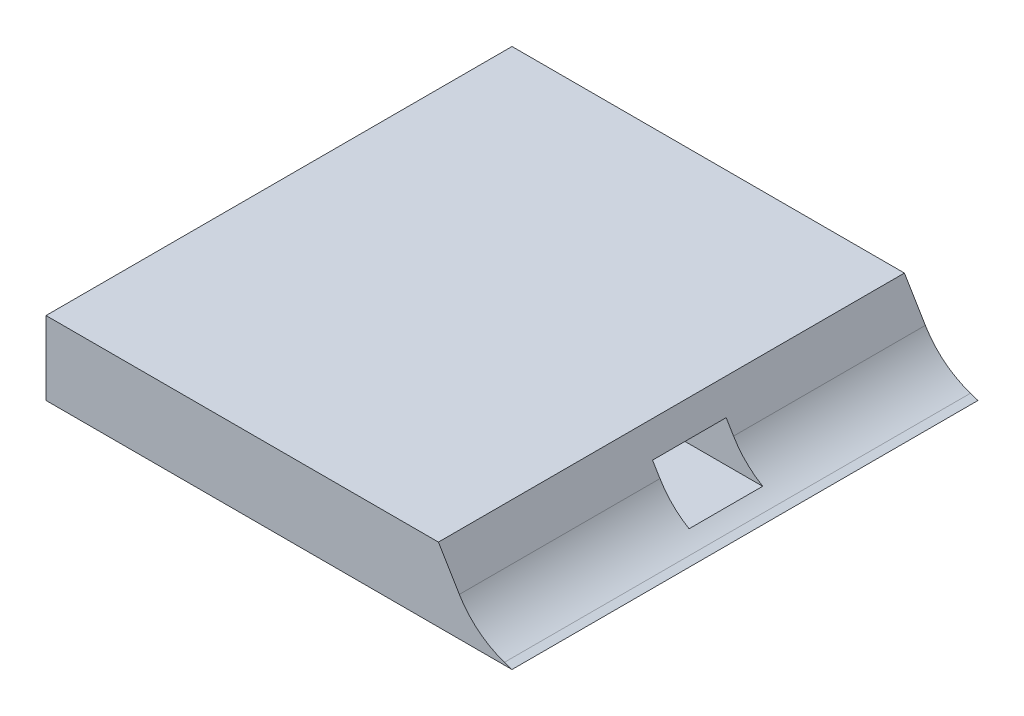
ISO-10303-21;
HEADER;
FILE_DESCRIPTION(('STEP AP214'),'2;1');
FILE_NAME('part.step','',(''),(''),'','','');
FILE_SCHEMA(('AUTOMOTIVE_DESIGN { 1 0 10303 214 1 1 1 1 }'));
ENDSEC;
DATA;
#1=APPLICATION_CONTEXT('core data for automotive mechanical design processes');
#2=APPLICATION_PROTOCOL_DEFINITION('international standard','automotive_design',2000,#1);
#3=PRODUCT_CONTEXT('',#1,'mechanical');
#4=PRODUCT('Part','Part','',(#3));
#5=PRODUCT_RELATED_PRODUCT_CATEGORY('part','',(#4));
#6=PRODUCT_DEFINITION_FORMATION('','',#4);
#7=PRODUCT_DEFINITION_CONTEXT('part definition',#1,'design');
#8=PRODUCT_DEFINITION('design','',#6,#7);
#9=PRODUCT_DEFINITION_SHAPE('','',#8);
#10=(LENGTH_UNIT() NAMED_UNIT(*) SI_UNIT(.MILLI.,.METRE.));
#11=(NAMED_UNIT(*) PLANE_ANGLE_UNIT() SI_UNIT($,.RADIAN.));
#12=(NAMED_UNIT(*) SI_UNIT($,.STERADIAN.) SOLID_ANGLE_UNIT());
#13=UNCERTAINTY_MEASURE_WITH_UNIT(LENGTH_MEASURE(1.E-05),#10,'distance_accuracy_value','');
#14=(GEOMETRIC_REPRESENTATION_CONTEXT(3) GLOBAL_UNCERTAINTY_ASSIGNED_CONTEXT((#13)) GLOBAL_UNIT_ASSIGNED_CONTEXT((#10,
#11,#12)) REPRESENTATION_CONTEXT('',''));
#15=CARTESIAN_POINT('',(0.,0.,0.));
#16=DIRECTION('',(0.,0.,1.));
#17=DIRECTION('',(1.,0.,0.));
#18=AXIS2_PLACEMENT_3D('',#15,#16,#17);
#19=CARTESIAN_POINT('',(-45.,15.,-47.5));
#20=DIRECTION('',(0.,0.,1.));
#21=DIRECTION('',(1.,0.,0.));
#22=AXIS2_PLACEMENT_3D('',#19,#20,#21);
#23=PLANE('',#22);
#24=DIRECTION('',(0.514495755427526,-0.857492925712544,0.));
#25=VECTOR('',#24,1.);
#26=CARTESIAN_POINT('',(13.8235294117647,50.2941176470588,-47.5));
#27=LINE('',#26,#25);
#28=CARTESIAN_POINT('',(35.,15.,-47.5));
#29=VERTEX_POINT('',#28);
#30=CARTESIAN_POINT('',(39.2644857602636,7.89252373289388,-47.5));
#31=VERTEX_POINT('',#30);
#32=EDGE_CURVE('E121',#29,#31,#27,.T.);
#33=ORIENTED_EDGE('',*,*,#32,.T.);
#34=CARTESIAN_POINT('',(53.8418654973769,16.6389515751618,-47.5));
#35=DIRECTION('',(0.,0.,1.));
#36=DIRECTION('',(1.,0.,0.));
#37=AXIS2_PLACEMENT_3D('',#34,#35,#36);
#38=CIRCLE('',#37,17.);
#39=CARTESIAN_POINT('',(48.4659934750907,0.511335508303099,-47.5));
#40=VERTEX_POINT('',#39);
#41=EDGE_CURVE('E11',#31,#40,#38,.T.);
#42=ORIENTED_EDGE('',*,*,#41,.T.);
#43=DIRECTION('',(0.948683298050514,-0.316227766016838,0.));
#44=VECTOR('',#43,1.);
#45=CARTESIAN_POINT('',(-40.,30.,-47.5));
#46=LINE('',#45,#44);
#47=CARTESIAN_POINT('',(50.,0.,-47.5));
#48=VERTEX_POINT('',#47);
#49=EDGE_CURVE('E188',#40,#48,#46,.T.);
#50=ORIENTED_EDGE('',*,*,#49,.T.);
#51=DIRECTION('',(-1.,0.,0.));
#52=VECTOR('',#51,1.);
#53=CARTESIAN_POINT('',(-45.,0.,-47.5));
#54=LINE('',#53,#52);
#55=CARTESIAN_POINT('',(-45.,0.,-47.5));
#56=VERTEX_POINT('',#55);
#57=EDGE_CURVE('E149',#48,#56,#54,.T.);
#58=ORIENTED_EDGE('',*,*,#57,.T.);
#59=DIRECTION('',(0.,-1.,0.));
#60=VECTOR('',#59,1.);
#61=CARTESIAN_POINT('',(-45.,15.,-47.5));
#62=LINE('',#61,#60);
#63=CARTESIAN_POINT('',(-45.,15.,-47.5));
#64=VERTEX_POINT('',#63);
#65=EDGE_CURVE('E143',#64,#56,#62,.T.);
#66=ORIENTED_EDGE('',*,*,#65,.F.);
#67=DIRECTION('',(-1.,0.,0.));
#68=VECTOR('',#67,1.);
#69=CARTESIAN_POINT('',(-45.,15.,-47.5));
#70=LINE('',#69,#68);
#71=EDGE_CURVE('E145',#29,#64,#70,.T.);
#72=ORIENTED_EDGE('',*,*,#71,.F.);
#73=EDGE_LOOP('',(#33,#42,#50,#58,#66,#72));
#74=FACE_BOUND('',#73,.T.);
#75=ADVANCED_FACE('F33',(#74),#23,.F.);
#76=CARTESIAN_POINT('',(-45.,15.,47.5));
#77=DIRECTION('',(1.,0.,0.));
#78=DIRECTION('',(0.,0.,-1.));
#79=AXIS2_PLACEMENT_3D('',#76,#77,#78);
#80=PLANE('',#79);
#81=DIRECTION('',(0.,0.,1.));
#82=VECTOR('',#81,1.);
#83=CARTESIAN_POINT('',(-45.,0.,47.5));
#84=LINE('',#83,#82);
#85=CARTESIAN_POINT('',(-45.,0.,47.5));
#86=VERTEX_POINT('',#85);
#87=EDGE_CURVE('E151',#56,#86,#84,.T.);
#88=ORIENTED_EDGE('',*,*,#87,.T.);
#89=DIRECTION('',(0.,-1.,0.));
#90=VECTOR('',#89,1.);
#91=CARTESIAN_POINT('',(-45.,15.,47.5));
#92=LINE('',#91,#90);
#93=CARTESIAN_POINT('',(-45.,15.,47.5));
#94=VERTEX_POINT('',#93);
#95=EDGE_CURVE('E141',#94,#86,#92,.T.);
#96=ORIENTED_EDGE('',*,*,#95,.F.);
#97=DIRECTION('',(0.,0.,1.));
#98=VECTOR('',#97,1.);
#99=CARTESIAN_POINT('',(-45.,15.,47.5));
#100=LINE('',#99,#98);
#101=EDGE_CURVE('E139',#64,#94,#100,.T.);
#102=ORIENTED_EDGE('',*,*,#101,.F.);
#103=ORIENTED_EDGE('',*,*,#65,.T.);
#104=EDGE_LOOP('',(#88,#96,#102,#103));
#105=FACE_BOUND('',#104,.T.);
#106=ADVANCED_FACE('F219',(#105),#80,.F.);
#107=CARTESIAN_POINT('',(-45.,15.,47.5));
#108=DIRECTION('',(0.,0.,-1.));
#109=DIRECTION('',(-1.,0.,0.));
#110=AXIS2_PLACEMENT_3D('',#107,#108,#109);
#111=PLANE('',#110);
#112=DIRECTION('',(1.,0.,0.));
#113=VECTOR('',#112,1.);
#114=CARTESIAN_POINT('',(-45.,0.,47.5));
#115=LINE('',#114,#113);
#116=CARTESIAN_POINT('',(50.,0.,47.5));
#117=VERTEX_POINT('',#116);
#118=EDGE_CURVE('E154',#86,#117,#115,.T.);
#119=ORIENTED_EDGE('',*,*,#118,.T.);
#120=DIRECTION('',(0.948683298050514,-0.316227766016838,0.));
#121=VECTOR('',#120,1.);
#122=CARTESIAN_POINT('',(42.5,2.5,47.5));
#123=LINE('',#122,#121);
#124=CARTESIAN_POINT('',(48.4659934750907,0.511335508303109,47.5));
#125=VERTEX_POINT('',#124);
#126=EDGE_CURVE('E126',#125,#117,#123,.T.);
#127=ORIENTED_EDGE('',*,*,#126,.F.);
#128=CARTESIAN_POINT('',(53.8418654973769,16.6389515751618,47.5));
#129=DIRECTION('',(0.,0.,-1.));
#130=DIRECTION('',(-1.,0.,0.));
#131=AXIS2_PLACEMENT_3D('',#128,#129,#130);
#132=CIRCLE('',#131,17.);
#133=CARTESIAN_POINT('',(39.2644857602637,7.89252373289389,47.5));
#134=VERTEX_POINT('',#133);
#135=EDGE_CURVE('E135',#125,#134,#132,.T.);
#136=ORIENTED_EDGE('',*,*,#135,.T.);
#137=DIRECTION('',(0.514495755427526,-0.857492925712544,0.));
#138=VECTOR('',#137,1.);
#139=CARTESIAN_POINT('',(35.,15.,47.5));
#140=LINE('',#139,#138);
#141=CARTESIAN_POINT('',(35.,15.,47.5));
#142=VERTEX_POINT('',#141);
#143=EDGE_CURVE('E118',#142,#134,#140,.T.);
#144=ORIENTED_EDGE('',*,*,#143,.F.);
#145=DIRECTION('',(1.,0.,0.));
#146=VECTOR('',#145,1.);
#147=CARTESIAN_POINT('',(-45.,15.,47.5));
#148=LINE('',#147,#146);
#149=EDGE_CURVE('E133',#94,#142,#148,.T.);
#150=ORIENTED_EDGE('',*,*,#149,.F.);
#151=ORIENTED_EDGE('',*,*,#95,.T.);
#152=EDGE_LOOP('',(#119,#127,#136,#144,#150,#151));
#153=FACE_BOUND('',#152,.T.);
#154=ADVANCED_FACE('F131',(#153),#111,.F.);
#155=CARTESIAN_POINT('',(0.,15.,0.));
#156=DIRECTION('',(0.,-1.,0.));
#157=DIRECTION('',(0.,0.,-1.));
#158=AXIS2_PLACEMENT_3D('',#155,#156,#157);
#159=PLANE('',#158);
#160=ORIENTED_EDGE('',*,*,#149,.T.);
#161=DIRECTION('',(0.,0.,1.));
#162=VECTOR('',#161,1.);
#163=CARTESIAN_POINT('',(35.,15.,-52.5));
#164=LINE('',#163,#162);
#165=EDGE_CURVE('E115',#29,#142,#164,.T.);
#166=ORIENTED_EDGE('',*,*,#165,.F.);
#167=ORIENTED_EDGE('',*,*,#71,.T.);
#168=ORIENTED_EDGE('',*,*,#101,.T.);
#169=EDGE_LOOP('',(#160,#166,#167,#168));
#170=FACE_BOUND('',#169,.T.);
#171=ADVANCED_FACE('F137',(#170),#159,.F.);
#172=CARTESIAN_POINT('',(0.,0.,0.));
#173=DIRECTION('',(0.,-1.,0.));
#174=DIRECTION('',(0.,0.,-1.));
#175=AXIS2_PLACEMENT_3D('',#172,#173,#174);
#176=PLANE('',#175);
#177=ORIENTED_EDGE('',*,*,#57,.F.);
#178=DIRECTION('',(0.,0.,-1.));
#179=VECTOR('',#178,1.);
#180=CARTESIAN_POINT('',(50.,0.,47.5));
#181=LINE('',#180,#179);
#182=EDGE_CURVE('E193',#117,#48,#181,.T.);
#183=ORIENTED_EDGE('',*,*,#182,.F.);
#184=ORIENTED_EDGE('',*,*,#118,.F.);
#185=ORIENTED_EDGE('',*,*,#87,.F.);
#186=EDGE_LOOP('',(#177,#183,#184,#185));
#187=FACE_BOUND('',#186,.T.);
#188=ADVANCED_FACE('F222',(#187),#176,.T.);
#189=CARTESIAN_POINT('',(42.5,2.5,-52.5));
#190=DIRECTION('',(-0.316227766016838,-0.948683298050514,0.));
#191=DIRECTION('',(0.948683298050514,-0.316227766016838,0.));
#192=AXIS2_PLACEMENT_3D('',#189,#190,#191);
#193=PLANE('',#192);
#194=ORIENTED_EDGE('',*,*,#49,.F.);
#195=DIRECTION('',(0.,0.,1.));
#196=VECTOR('',#195,1.);
#197=CARTESIAN_POINT('',(48.4659934750907,0.511335508303109,47.5));
#198=LINE('',#197,#196);
#199=EDGE_CURVE('E161',#40,#125,#198,.T.);
#200=ORIENTED_EDGE('',*,*,#199,.T.);
#201=ORIENTED_EDGE('',*,*,#126,.T.);
#202=ORIENTED_EDGE('',*,*,#182,.T.);
#203=EDGE_LOOP('',(#194,#200,#201,#202));
#204=FACE_BOUND('',#203,.T.);
#205=ADVANCED_FACE('F191',(#204),#193,.F.);
#206=CARTESIAN_POINT('',(35.,15.,-52.5));
#207=DIRECTION('',(-0.857492925712544,-0.514495755427526,0.));
#208=DIRECTION('',(0.514495755427526,-0.857492925712544,0.));
#209=AXIS2_PLACEMENT_3D('',#206,#207,#208);
#210=PLANE('',#209);
#211=ORIENTED_EDGE('',*,*,#143,.T.);
#212=DIRECTION('',(0.,0.,1.));
#213=VECTOR('',#212,1.);
#214=CARTESIAN_POINT('',(39.2644857602637,7.8925237328939,6.59999999999999));
#215=LINE('',#214,#213);
#216=CARTESIAN_POINT('',(39.2644857602637,7.8925237328939,6.6));
#217=VERTEX_POINT('',#216);
#218=EDGE_CURVE('E166',#134,#217,#215,.F.);
#219=ORIENTED_EDGE('',*,*,#218,.T.);
#220=DIRECTION('',(0.514495755427526,-0.857492925712544,0.));
#221=VECTOR('',#220,1.);
#222=CARTESIAN_POINT('',(32.7941176470588,18.6764705882353,6.6));
#223=LINE('',#222,#221);
#224=CARTESIAN_POINT('',(37.76,10.4,6.6));
#225=VERTEX_POINT('',#224);
#226=EDGE_CURVE('E158',#225,#217,#223,.T.);
#227=ORIENTED_EDGE('',*,*,#226,.F.);
#228=DIRECTION('',(0.,0.,1.));
#229=VECTOR('',#228,1.);
#230=CARTESIAN_POINT('',(37.76,10.4,6.59999999999999));
#231=LINE('',#230,#229);
#232=CARTESIAN_POINT('',(37.76,10.4,-8.4));
#233=VERTEX_POINT('',#232);
#234=EDGE_CURVE('E125',#233,#225,#231,.T.);
#235=ORIENTED_EDGE('',*,*,#234,.F.);
#236=DIRECTION('',(-0.514495755427526,0.857492925712544,0.));
#237=VECTOR('',#236,1.);
#238=CARTESIAN_POINT('',(32.7941176470588,18.6764705882353,-8.4));
#239=LINE('',#238,#237);
#240=CARTESIAN_POINT('',(39.2644857602637,7.8925237328939,-8.4));
#241=VERTEX_POINT('',#240);
#242=EDGE_CURVE('E175',#241,#233,#239,.T.);
#243=ORIENTED_EDGE('',*,*,#242,.F.);
#244=DIRECTION('',(0.,0.,-1.));
#245=VECTOR('',#244,1.);
#246=CARTESIAN_POINT('',(39.2644857602637,7.8925237328939,-27.95));
#247=LINE('',#246,#245);
#248=EDGE_CURVE('E164',#241,#31,#247,.T.);
#249=ORIENTED_EDGE('',*,*,#248,.T.);
#250=ORIENTED_EDGE('',*,*,#32,.F.);
#251=ORIENTED_EDGE('',*,*,#165,.T.);
#252=EDGE_LOOP('',(#211,#219,#227,#235,#243,#249,#250,#251));
#253=FACE_BOUND('',#252,.T.);
#254=ADVANCED_FACE('F117',(#253),#210,.F.);
#255=CARTESIAN_POINT('',(5.,0.,0.));
#256=DIRECTION('',(-1.,0.,0.));
#257=DIRECTION('',(0.,0.,1.));
#258=AXIS2_PLACEMENT_3D('',#255,#256,#257);
#259=PLANE('',#258);
#260=DIRECTION('',(0.,-1.,0.));
#261=VECTOR('',#260,1.);
#262=CARTESIAN_POINT('',(5.,2.,6.6));
#263=LINE('',#262,#261);
#264=CARTESIAN_POINT('',(5.,10.4,6.6));
#265=VERTEX_POINT('',#264);
#266=CARTESIAN_POINT('',(5.,2.,6.6));
#267=VERTEX_POINT('',#266);
#268=EDGE_CURVE('E196',#265,#267,#263,.T.);
#269=ORIENTED_EDGE('',*,*,#268,.T.);
#270=DIRECTION('',(0.,0.,-1.));
#271=VECTOR('',#270,1.);
#272=CARTESIAN_POINT('',(5.,2.,6.6));
#273=LINE('',#272,#271);
#274=CARTESIAN_POINT('',(5.,2.,-8.4));
#275=VERTEX_POINT('',#274);
#276=EDGE_CURVE('E202',#267,#275,#273,.T.);
#277=ORIENTED_EDGE('',*,*,#276,.T.);
#278=DIRECTION('',(0.,1.,0.));
#279=VECTOR('',#278,1.);
#280=CARTESIAN_POINT('',(5.,2.,-8.4));
#281=LINE('',#280,#279);
#282=CARTESIAN_POINT('',(5.,10.4,-8.4));
#283=VERTEX_POINT('',#282);
#284=EDGE_CURVE('E205',#275,#283,#281,.T.);
#285=ORIENTED_EDGE('',*,*,#284,.T.);
#286=DIRECTION('',(0.,0.,1.));
#287=VECTOR('',#286,1.);
#288=CARTESIAN_POINT('',(5.,10.4,6.6));
#289=LINE('',#288,#287);
#290=EDGE_CURVE('E208',#283,#265,#289,.T.);
#291=ORIENTED_EDGE('',*,*,#290,.T.);
#292=EDGE_LOOP('',(#269,#277,#285,#291));
#293=FACE_BOUND('',#292,.T.);
#294=ADVANCED_FACE('F257',(#293),#259,.F.);
#295=CARTESIAN_POINT('',(5.,2.,6.6));
#296=DIRECTION('',(0.,-1.,0.));
#297=DIRECTION('',(0.,0.,-1.));
#298=AXIS2_PLACEMENT_3D('',#295,#296,#297);
#299=PLANE('',#298);
#300=DIRECTION('',(1.,0.,0.));
#301=VECTOR('',#300,1.);
#302=CARTESIAN_POINT('',(5.,2.,6.6));
#303=LINE('',#302,#301);
#304=CARTESIAN_POINT('',(45.1988858734239,2.,6.6));
#305=VERTEX_POINT('',#304);
#306=EDGE_CURVE('E55',#267,#305,#303,.T.);
#307=ORIENTED_EDGE('',*,*,#306,.T.);
#308=DIRECTION('',(0.,0.,-1.));
#309=VECTOR('',#308,1.);
#310=CARTESIAN_POINT('',(45.1988858734239,2.,6.6));
#311=LINE('',#310,#309);
#312=CARTESIAN_POINT('',(45.1988858734239,2.,-8.4));
#313=VERTEX_POINT('',#312);
#314=EDGE_CURVE('E171',#305,#313,#311,.T.);
#315=ORIENTED_EDGE('',*,*,#314,.T.);
#316=DIRECTION('',(1.,0.,0.));
#317=VECTOR('',#316,1.);
#318=CARTESIAN_POINT('',(5.,2.,-8.4));
#319=LINE('',#318,#317);
#320=EDGE_CURVE('E48',#275,#313,#319,.T.);
#321=ORIENTED_EDGE('',*,*,#320,.F.);
#322=ORIENTED_EDGE('',*,*,#276,.F.);
#323=EDGE_LOOP('',(#307,#315,#321,#322));
#324=FACE_BOUND('',#323,.T.);
#325=ADVANCED_FACE('F264',(#324),#299,.F.);
#326=CARTESIAN_POINT('',(5.,2.,-8.4));
#327=DIRECTION('',(0.,0.,-1.));
#328=DIRECTION('',(-1.,0.,0.));
#329=AXIS2_PLACEMENT_3D('',#326,#327,#328);
#330=PLANE('',#329);
#331=ORIENTED_EDGE('',*,*,#320,.T.);
#332=CARTESIAN_POINT('',(53.8418654973769,16.6389515751618,-8.4));
#333=DIRECTION('',(0.,0.,-1.));
#334=DIRECTION('',(-1.,0.,0.));
#335=AXIS2_PLACEMENT_3D('',#332,#333,#334);
#336=CIRCLE('',#335,17.);
#337=EDGE_CURVE('E41',#313,#241,#336,.T.);
#338=ORIENTED_EDGE('',*,*,#337,.T.);
#339=ORIENTED_EDGE('',*,*,#242,.T.);
#340=DIRECTION('',(1.,0.,0.));
#341=VECTOR('',#340,1.);
#342=CARTESIAN_POINT('',(5.,10.4,-8.4));
#343=LINE('',#342,#341);
#344=EDGE_CURVE('E213',#283,#233,#343,.T.);
#345=ORIENTED_EDGE('',*,*,#344,.F.);
#346=ORIENTED_EDGE('',*,*,#284,.F.);
#347=EDGE_LOOP('',(#331,#338,#339,#345,#346));
#348=FACE_BOUND('',#347,.T.);
#349=ADVANCED_FACE('F174',(#348),#330,.F.);
#350=CARTESIAN_POINT('',(5.,10.4,6.6));
#351=DIRECTION('',(0.,1.,0.));
#352=DIRECTION('',(0.,0.,1.));
#353=AXIS2_PLACEMENT_3D('',#350,#351,#352);
#354=PLANE('',#353);
#355=ORIENTED_EDGE('',*,*,#344,.T.);
#356=ORIENTED_EDGE('',*,*,#234,.T.);
#357=DIRECTION('',(1.,0.,0.));
#358=VECTOR('',#357,1.);
#359=CARTESIAN_POINT('',(5.,10.4,6.6));
#360=LINE('',#359,#358);
#361=EDGE_CURVE('E152',#265,#225,#360,.T.);
#362=ORIENTED_EDGE('',*,*,#361,.F.);
#363=ORIENTED_EDGE('',*,*,#290,.F.);
#364=EDGE_LOOP('',(#355,#356,#362,#363));
#365=FACE_BOUND('',#364,.T.);
#366=ADVANCED_FACE('F275',(#365),#354,.F.);
#367=CARTESIAN_POINT('',(5.,2.,6.6));
#368=DIRECTION('',(0.,0.,1.));
#369=DIRECTION('',(1.,0.,0.));
#370=AXIS2_PLACEMENT_3D('',#367,#368,#369);
#371=PLANE('',#370);
#372=ORIENTED_EDGE('',*,*,#226,.T.);
#373=CARTESIAN_POINT('',(53.8418654973769,16.6389515751618,6.59999999999999));
#374=DIRECTION('',(0.,0.,1.));
#375=DIRECTION('',(1.,0.,0.));
#376=AXIS2_PLACEMENT_3D('',#373,#374,#375);
#377=CIRCLE('',#376,17.);
#378=EDGE_CURVE('E169',#217,#305,#377,.T.);
#379=ORIENTED_EDGE('',*,*,#378,.T.);
#380=ORIENTED_EDGE('',*,*,#306,.F.);
#381=ORIENTED_EDGE('',*,*,#268,.F.);
#382=ORIENTED_EDGE('',*,*,#361,.T.);
#383=EDGE_LOOP('',(#372,#379,#380,#381,#382));
#384=FACE_BOUND('',#383,.T.);
#385=ADVANCED_FACE('F280',(#384),#371,.F.);
#386=CARTESIAN_POINT('',(53.8418654973769,16.6389515751618,-52.5));
#387=DIRECTION('',(0.,0.,-1.));
#388=DIRECTION('',(-1.,0.,0.));
#389=AXIS2_PLACEMENT_3D('',#386,#387,#388);
#390=CYLINDRICAL_SURFACE('',#389,17.);
#391=ORIENTED_EDGE('',*,*,#378,.F.);
#392=ORIENTED_EDGE('',*,*,#218,.F.);
#393=ORIENTED_EDGE('',*,*,#135,.F.);
#394=ORIENTED_EDGE('',*,*,#199,.F.);
#395=ORIENTED_EDGE('',*,*,#41,.F.);
#396=ORIENTED_EDGE('',*,*,#248,.F.);
#397=ORIENTED_EDGE('',*,*,#337,.F.);
#398=ORIENTED_EDGE('',*,*,#314,.F.);
#399=EDGE_LOOP('',(#391,#392,#393,#394,#395,#396,#397,#398));
#400=FACE_BOUND('',#399,.T.);
#401=ADVANCED_FACE('F35',(#400),#390,.F.);
#402=CLOSED_SHELL('',(#75,#106,#154,#171,#188,#205,#254,#294,#325,#349,#366,#385,#401));
#403=MANIFOLD_SOLID_BREP('B2',#402);
#404=ADVANCED_BREP_SHAPE_REPRESENTATION('',(#18,#403),#14);
#405=SHAPE_DEFINITION_REPRESENTATION(#9,#404);
ENDSEC;
END-ISO-10303-21;
